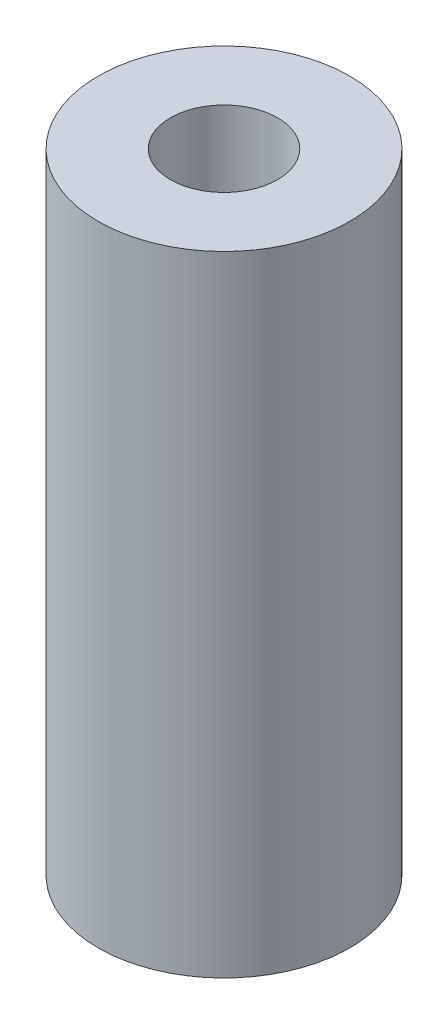
ISO-10303-21;
HEADER;
FILE_DESCRIPTION(('STEP AP214'),'2;1');
FILE_NAME('part.step','',(''),(''),'','','');
FILE_SCHEMA(('AUTOMOTIVE_DESIGN { 1 0 10303 214 1 1 1 1 }'));
ENDSEC;
DATA;
#1=APPLICATION_CONTEXT('core data for automotive mechanical design processes');
#2=APPLICATION_PROTOCOL_DEFINITION('international standard','automotive_design',2000,#1);
#3=PRODUCT_CONTEXT('',#1,'mechanical');
#4=PRODUCT('Part','Part','',(#3));
#5=PRODUCT_RELATED_PRODUCT_CATEGORY('part','',(#4));
#6=PRODUCT_DEFINITION_FORMATION('','',#4);
#7=PRODUCT_DEFINITION_CONTEXT('part definition',#1,'design');
#8=PRODUCT_DEFINITION('design','',#6,#7);
#9=PRODUCT_DEFINITION_SHAPE('','',#8);
#10=(LENGTH_UNIT() NAMED_UNIT(*) SI_UNIT(.MILLI.,.METRE.));
#11=(NAMED_UNIT(*) PLANE_ANGLE_UNIT() SI_UNIT($,.RADIAN.));
#12=(NAMED_UNIT(*) SI_UNIT($,.STERADIAN.) SOLID_ANGLE_UNIT());
#13=UNCERTAINTY_MEASURE_WITH_UNIT(LENGTH_MEASURE(1.E-05),#10,'distance_accuracy_value','');
#14=(GEOMETRIC_REPRESENTATION_CONTEXT(3) GLOBAL_UNCERTAINTY_ASSIGNED_CONTEXT((#13)) GLOBAL_UNIT_ASSIGNED_CONTEXT((#10,
#11,#12)) REPRESENTATION_CONTEXT('',''));
#15=CARTESIAN_POINT('',(0.,0.,0.));
#16=DIRECTION('',(0.,0.,1.));
#17=DIRECTION('',(1.,0.,0.));
#18=AXIS2_PLACEMENT_3D('',#15,#16,#17);
#19=CARTESIAN_POINT('',(0.,15.875,0.));
#20=DIRECTION('',(0.,1.,0.));
#21=DIRECTION('',(0.,0.,1.));
#22=AXIS2_PLACEMENT_3D('',#19,#20,#21);
#23=PLANE('',#22);
#24=CARTESIAN_POINT('',(0.,15.875,0.));
#25=DIRECTION('',(0.,1.,0.));
#26=DIRECTION('',(0.,0.,1.));
#27=AXIS2_PLACEMENT_3D('',#24,#25,#26);
#28=CIRCLE('',#27,3.175);
#29=CARTESIAN_POINT('',(0.,15.875,3.175));
#30=VERTEX_POINT('',#29);
#31=EDGE_CURVE('E10',#30,#30,#28,.T.);
#32=ORIENTED_EDGE('',*,*,#31,.T.);
#33=EDGE_LOOP('',(#32));
#34=FACE_BOUND('',#33,.T.);
#35=CARTESIAN_POINT('',(0.,15.875,0.));
#36=DIRECTION('',(0.,1.,0.));
#37=DIRECTION('',(0.,0.,1.));
#38=AXIS2_PLACEMENT_3D('',#35,#36,#37);
#39=CIRCLE('',#38,1.35255);
#40=CARTESIAN_POINT('',(0.,15.875,1.35255));
#41=VERTEX_POINT('',#40);
#42=EDGE_CURVE('E369',#41,#41,#39,.T.);
#43=ORIENTED_EDGE('',*,*,#42,.F.);
#44=EDGE_LOOP('',(#43));
#45=FACE_BOUND('',#44,.T.);
#46=ADVANCED_FACE('F358',(#34,#45),#23,.T.);
#47=CARTESIAN_POINT('',(0.,0.,0.));
#48=DIRECTION('',(0.,1.,0.));
#49=DIRECTION('',(0.,0.,1.));
#50=AXIS2_PLACEMENT_3D('',#47,#48,#49);
#51=PLANE('',#50);
#52=CARTESIAN_POINT('',(0.,0.,0.));
#53=DIRECTION('',(0.,1.,0.));
#54=DIRECTION('',(0.,0.,1.));
#55=AXIS2_PLACEMENT_3D('',#52,#53,#54);
#56=CIRCLE('',#55,3.175);
#57=CARTESIAN_POINT('',(0.,0.,3.175));
#58=VERTEX_POINT('',#57);
#59=EDGE_CURVE('E365',#58,#58,#56,.T.);
#60=ORIENTED_EDGE('',*,*,#59,.F.);
#61=EDGE_LOOP('',(#60));
#62=FACE_BOUND('',#61,.T.);
#63=CARTESIAN_POINT('',(0.,0.,0.));
#64=DIRECTION('',(0.,1.,0.));
#65=DIRECTION('',(0.,0.,1.));
#66=AXIS2_PLACEMENT_3D('',#63,#64,#65);
#67=CIRCLE('',#66,1.35255);
#68=CARTESIAN_POINT('',(0.,0.,1.35255));
#69=VERTEX_POINT('',#68);
#70=EDGE_CURVE('E373',#69,#69,#67,.T.);
#71=ORIENTED_EDGE('',*,*,#70,.T.);
#72=EDGE_LOOP('',(#71));
#73=FACE_BOUND('',#72,.T.);
#74=ADVANCED_FACE('F379',(#62,#73),#51,.F.);
#75=CARTESIAN_POINT('',(0.,15.875,0.));
#76=DIRECTION('',(0.,-1.,0.));
#77=DIRECTION('',(0.,0.,-1.));
#78=AXIS2_PLACEMENT_3D('',#75,#76,#77);
#79=CYLINDRICAL_SURFACE('',#78,3.175);
#80=ORIENTED_EDGE('',*,*,#31,.F.);
#81=EDGE_LOOP('',(#80));
#82=FACE_BOUND('',#81,.T.);
#83=ORIENTED_EDGE('',*,*,#59,.T.);
#84=EDGE_LOOP('',(#83));
#85=FACE_BOUND('',#84,.T.);
#86=ADVANCED_FACE('F360',(#82,#85),#79,.T.);
#87=CARTESIAN_POINT('',(0.,15.875,0.));
#88=DIRECTION('',(0.,-1.,0.));
#89=DIRECTION('',(0.,0.,-1.));
#90=AXIS2_PLACEMENT_3D('',#87,#88,#89);
#91=CYLINDRICAL_SURFACE('',#90,1.35255);
#92=ORIENTED_EDGE('',*,*,#42,.T.);
#93=EDGE_LOOP('',(#92));
#94=FACE_BOUND('',#93,.T.);
#95=ORIENTED_EDGE('',*,*,#70,.F.);
#96=EDGE_LOOP('',(#95));
#97=FACE_BOUND('',#96,.T.);
#98=ADVANCED_FACE('F381',(#94,#97),#91,.F.);
#99=CLOSED_SHELL('',(#46,#74,#86,#98));
#100=MANIFOLD_SOLID_BREP('B2',#99);
#101=ADVANCED_BREP_SHAPE_REPRESENTATION('',(#18,#100),#14);
#102=SHAPE_DEFINITION_REPRESENTATION(#9,#101);
ENDSEC;
END-ISO-10303-21;
